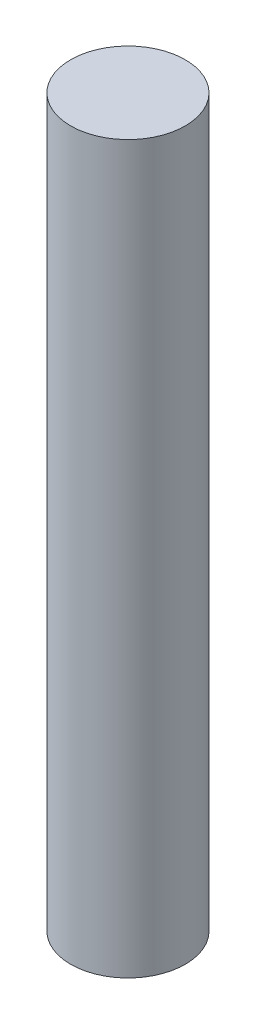
ISO-10303-21;
HEADER;
FILE_DESCRIPTION(('STEP AP214'),'2;1');
FILE_NAME('part.step','',(''),(''),'','','');
FILE_SCHEMA(('AUTOMOTIVE_DESIGN { 1 0 10303 214 1 1 1 1 }'));
ENDSEC;
DATA;
#1=APPLICATION_CONTEXT('core data for automotive mechanical design processes');
#2=APPLICATION_PROTOCOL_DEFINITION('international standard','automotive_design',2000,#1);
#3=PRODUCT_CONTEXT('',#1,'mechanical');
#4=PRODUCT('Part','Part','',(#3));
#5=PRODUCT_RELATED_PRODUCT_CATEGORY('part','',(#4));
#6=PRODUCT_DEFINITION_FORMATION('','',#4);
#7=PRODUCT_DEFINITION_CONTEXT('part definition',#1,'design');
#8=PRODUCT_DEFINITION('design','',#6,#7);
#9=PRODUCT_DEFINITION_SHAPE('','',#8);
#10=(LENGTH_UNIT() NAMED_UNIT(*) SI_UNIT(.MILLI.,.METRE.));
#11=(NAMED_UNIT(*) PLANE_ANGLE_UNIT() SI_UNIT($,.RADIAN.));
#12=(NAMED_UNIT(*) SI_UNIT($,.STERADIAN.) SOLID_ANGLE_UNIT());
#13=UNCERTAINTY_MEASURE_WITH_UNIT(LENGTH_MEASURE(1.E-05),#10,'distance_accuracy_value','');
#14=(GEOMETRIC_REPRESENTATION_CONTEXT(3) GLOBAL_UNCERTAINTY_ASSIGNED_CONTEXT((#13)) GLOBAL_UNIT_ASSIGNED_CONTEXT((#10,
#11,#12)) REPRESENTATION_CONTEXT('',''));
#15=CARTESIAN_POINT('',(0.,0.,0.));
#16=DIRECTION('',(0.,0.,1.));
#17=DIRECTION('',(1.,0.,0.));
#18=AXIS2_PLACEMENT_3D('',#15,#16,#17);
#19=CARTESIAN_POINT('',(0.,95.,0.));
#20=DIRECTION('',(0.,-1.,0.));
#21=DIRECTION('',(0.,0.,-1.));
#22=AXIS2_PLACEMENT_3D('',#19,#20,#21);
#23=CYLINDRICAL_SURFACE('',#22,7.5);
#24=CARTESIAN_POINT('',(0.,95.,0.));
#25=DIRECTION('',(0.,1.,0.));
#26=DIRECTION('',(0.,0.,1.));
#27=AXIS2_PLACEMENT_3D('',#24,#25,#26);
#28=CIRCLE('',#27,7.5);
#29=CARTESIAN_POINT('',(0.,95.,7.5));
#30=VERTEX_POINT('',#29);
#31=EDGE_CURVE('E10',#30,#30,#28,.T.);
#32=ORIENTED_EDGE('',*,*,#31,.F.);
#33=EDGE_LOOP('',(#32));
#34=FACE_BOUND('',#33,.T.);
#35=CARTESIAN_POINT('',(0.,0.,0.));
#36=DIRECTION('',(0.,1.,0.));
#37=DIRECTION('',(0.,0.,1.));
#38=AXIS2_PLACEMENT_3D('',#35,#36,#37);
#39=CIRCLE('',#38,7.5);
#40=CARTESIAN_POINT('',(0.,0.,7.5));
#41=VERTEX_POINT('',#40);
#42=EDGE_CURVE('E40',#41,#41,#39,.T.);
#43=ORIENTED_EDGE('',*,*,#42,.T.);
#44=EDGE_LOOP('',(#43));
#45=FACE_BOUND('',#44,.T.);
#46=ADVANCED_FACE('F37',(#34,#45),#23,.T.);
#47=CARTESIAN_POINT('',(0.,95.,0.));
#48=DIRECTION('',(0.,1.,0.));
#49=DIRECTION('',(0.,0.,1.));
#50=AXIS2_PLACEMENT_3D('',#47,#48,#49);
#51=PLANE('',#50);
#52=ORIENTED_EDGE('',*,*,#31,.T.);
#53=EDGE_LOOP('',(#52));
#54=FACE_BOUND('',#53,.T.);
#55=ADVANCED_FACE('F54',(#54),#51,.T.);
#56=CARTESIAN_POINT('',(0.,0.,0.));
#57=DIRECTION('',(0.,1.,0.));
#58=DIRECTION('',(0.,0.,1.));
#59=AXIS2_PLACEMENT_3D('',#56,#57,#58);
#60=PLANE('',#59);
#61=ORIENTED_EDGE('',*,*,#42,.F.);
#62=EDGE_LOOP('',(#61));
#63=FACE_BOUND('',#62,.T.);
#64=ADVANCED_FACE('F52',(#63),#60,.F.);
#65=CLOSED_SHELL('',(#46,#55,#64));
#66=MANIFOLD_SOLID_BREP('B2',#65);
#67=ADVANCED_BREP_SHAPE_REPRESENTATION('',(#18,#66),#14);
#68=SHAPE_DEFINITION_REPRESENTATION(#9,#67);
ENDSEC;
END-ISO-10303-21;
